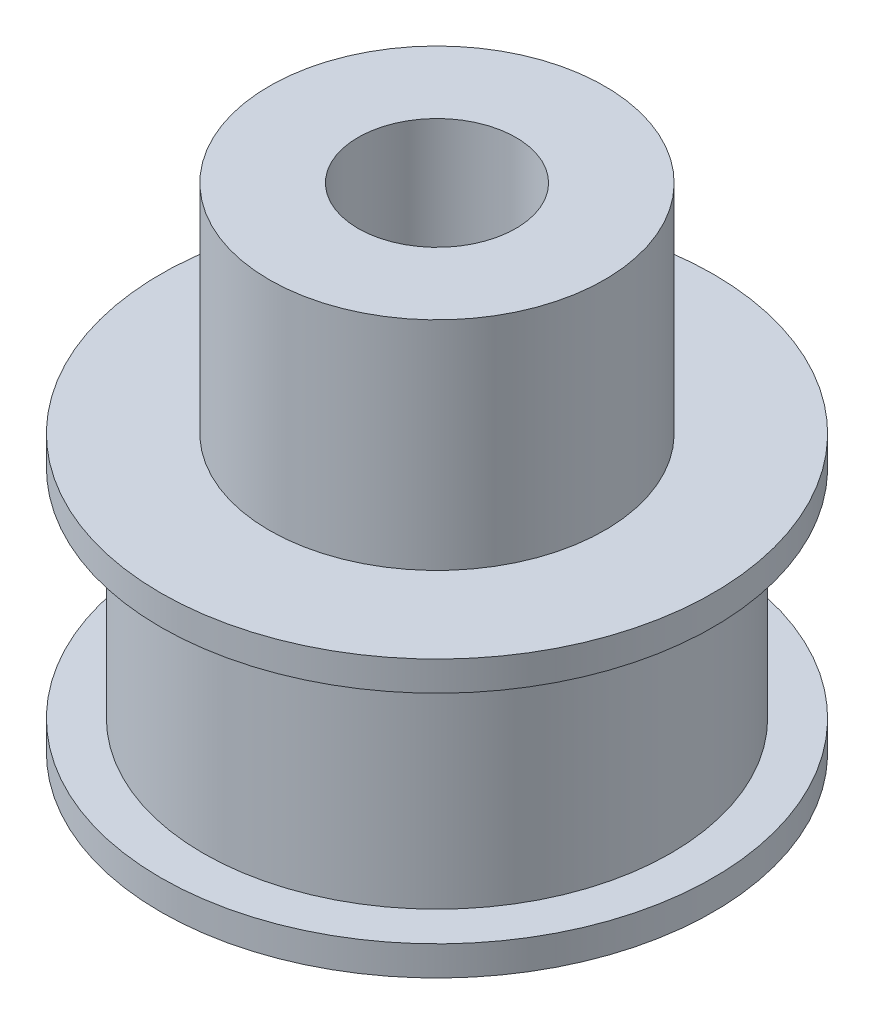
ISO-10303-21;
HEADER;
FILE_DESCRIPTION(('STEP AP214'),'2;1');
FILE_NAME('part.step','',(''),(''),'','','');
FILE_SCHEMA(('AUTOMOTIVE_DESIGN { 1 0 10303 214 1 1 1 1 }'));
ENDSEC;
DATA;
#1=APPLICATION_CONTEXT('core data for automotive mechanical design processes');
#2=APPLICATION_PROTOCOL_DEFINITION('international standard','automotive_design',2000,#1);
#3=PRODUCT_CONTEXT('',#1,'mechanical');
#4=PRODUCT('Part','Part','',(#3));
#5=PRODUCT_RELATED_PRODUCT_CATEGORY('part','',(#4));
#6=PRODUCT_DEFINITION_FORMATION('','',#4);
#7=PRODUCT_DEFINITION_CONTEXT('part definition',#1,'design');
#8=PRODUCT_DEFINITION('design','',#6,#7);
#9=PRODUCT_DEFINITION_SHAPE('','',#8);
#10=(LENGTH_UNIT() NAMED_UNIT(*) SI_UNIT(.MILLI.,.METRE.));
#11=(NAMED_UNIT(*) PLANE_ANGLE_UNIT() SI_UNIT($,.RADIAN.));
#12=(NAMED_UNIT(*) SI_UNIT($,.STERADIAN.) SOLID_ANGLE_UNIT());
#13=UNCERTAINTY_MEASURE_WITH_UNIT(LENGTH_MEASURE(1.E-05),#10,'distance_accuracy_value','');
#14=(GEOMETRIC_REPRESENTATION_CONTEXT(3) GLOBAL_UNCERTAINTY_ASSIGNED_CONTEXT((#13)) GLOBAL_UNIT_ASSIGNED_CONTEXT((#10,
#11,#12)) REPRESENTATION_CONTEXT('',''));
#15=CARTESIAN_POINT('',(0.,0.,0.));
#16=DIRECTION('',(0.,0.,1.));
#17=DIRECTION('',(1.,0.,0.));
#18=AXIS2_PLACEMENT_3D('',#15,#16,#17);
#19=CARTESIAN_POINT('',(0.,1.5,0.));
#20=DIRECTION('',(0.,-1.,0.));
#21=DIRECTION('',(0.,0.,-1.));
#22=AXIS2_PLACEMENT_3D('',#19,#20,#21);
#23=CYLINDRICAL_SURFACE('',#22,14.);
#24=CARTESIAN_POINT('',(0.,1.5,0.));
#25=DIRECTION('',(0.,1.,0.));
#26=DIRECTION('',(0.,0.,1.));
#27=AXIS2_PLACEMENT_3D('',#24,#25,#26);
#28=CIRCLE('',#27,14.);
#29=CARTESIAN_POINT('',(0.,1.5,14.));
#30=VERTEX_POINT('',#29);
#31=EDGE_CURVE('E10',#30,#30,#28,.T.);
#32=ORIENTED_EDGE('',*,*,#31,.F.);
#33=EDGE_LOOP('',(#32));
#34=FACE_BOUND('',#33,.T.);
#35=CARTESIAN_POINT('',(0.,0.,0.));
#36=DIRECTION('',(0.,1.,0.));
#37=DIRECTION('',(0.,0.,1.));
#38=AXIS2_PLACEMENT_3D('',#35,#36,#37);
#39=CIRCLE('',#38,14.);
#40=CARTESIAN_POINT('',(0.,0.,14.));
#41=VERTEX_POINT('',#40);
#42=EDGE_CURVE('E36',#41,#41,#39,.T.);
#43=ORIENTED_EDGE('',*,*,#42,.T.);
#44=EDGE_LOOP('',(#43));
#45=FACE_BOUND('',#44,.T.);
#46=ADVANCED_FACE('F33',(#34,#45),#23,.T.);
#47=CARTESIAN_POINT('',(0.,1.5,0.));
#48=DIRECTION('',(0.,1.,0.));
#49=DIRECTION('',(0.,0.,1.));
#50=AXIS2_PLACEMENT_3D('',#47,#48,#49);
#51=PLANE('',#50);
#52=CARTESIAN_POINT('',(0.,1.5,0.));
#53=DIRECTION('',(0.,1.,0.));
#54=DIRECTION('',(0.,0.,1.));
#55=AXIS2_PLACEMENT_3D('',#52,#53,#54);
#56=CIRCLE('',#55,11.85);
#57=CARTESIAN_POINT('',(0.,1.5,11.85));
#58=VERTEX_POINT('',#57);
#59=EDGE_CURVE('E45',#58,#58,#56,.T.);
#60=ORIENTED_EDGE('',*,*,#59,.F.);
#61=EDGE_LOOP('',(#60));
#62=FACE_BOUND('',#61,.T.);
#63=ORIENTED_EDGE('',*,*,#31,.T.);
#64=EDGE_LOOP('',(#63));
#65=FACE_BOUND('',#64,.T.);
#66=ADVANCED_FACE('F110',(#62,#65),#51,.T.);
#67=CARTESIAN_POINT('',(0.,0.,0.));
#68=DIRECTION('',(0.,1.,0.));
#69=DIRECTION('',(0.,0.,1.));
#70=AXIS2_PLACEMENT_3D('',#67,#68,#69);
#71=PLANE('',#70);
#72=CARTESIAN_POINT('',(0.,0.,0.));
#73=DIRECTION('',(0.,1.,0.));
#74=DIRECTION('',(0.,0.,1.));
#75=AXIS2_PLACEMENT_3D('',#72,#73,#74);
#76=CIRCLE('',#75,4.);
#77=CARTESIAN_POINT('',(0.,0.,4.));
#78=VERTEX_POINT('',#77);
#79=EDGE_CURVE('E60',#78,#78,#76,.T.);
#80=ORIENTED_EDGE('',*,*,#79,.T.);
#81=EDGE_LOOP('',(#80));
#82=FACE_BOUND('',#81,.T.);
#83=ORIENTED_EDGE('',*,*,#42,.F.);
#84=EDGE_LOOP('',(#83));
#85=FACE_BOUND('',#84,.T.);
#86=ADVANCED_FACE('F69',(#82,#85),#71,.F.);
#87=CARTESIAN_POINT('',(0.,12.5,0.));
#88=DIRECTION('',(0.,-1.,0.));
#89=DIRECTION('',(0.,0.,-1.));
#90=AXIS2_PLACEMENT_3D('',#87,#88,#89);
#91=CYLINDRICAL_SURFACE('',#90,11.85);
#92=CARTESIAN_POINT('',(0.,12.5,0.));
#93=DIRECTION('',(0.,1.,0.));
#94=DIRECTION('',(0.,0.,1.));
#95=AXIS2_PLACEMENT_3D('',#92,#93,#94);
#96=CIRCLE('',#95,11.85);
#97=CARTESIAN_POINT('',(0.,12.5,11.85));
#98=VERTEX_POINT('',#97);
#99=EDGE_CURVE('E43',#98,#98,#96,.T.);
#100=ORIENTED_EDGE('',*,*,#99,.F.);
#101=EDGE_LOOP('',(#100));
#102=FACE_BOUND('',#101,.T.);
#103=ORIENTED_EDGE('',*,*,#59,.T.);
#104=EDGE_LOOP('',(#103));
#105=FACE_BOUND('',#104,.T.);
#106=ADVANCED_FACE('F100',(#102,#105),#91,.T.);
#107=CARTESIAN_POINT('',(0.,14.,0.));
#108=DIRECTION('',(0.,-1.,0.));
#109=DIRECTION('',(0.,0.,-1.));
#110=AXIS2_PLACEMENT_3D('',#107,#108,#109);
#111=CYLINDRICAL_SURFACE('',#110,14.);
#112=CARTESIAN_POINT('',(0.,14.,0.));
#113=DIRECTION('',(0.,1.,0.));
#114=DIRECTION('',(0.,0.,1.));
#115=AXIS2_PLACEMENT_3D('',#112,#113,#114);
#116=CIRCLE('',#115,14.);
#117=CARTESIAN_POINT('',(0.,14.,14.));
#118=VERTEX_POINT('',#117);
#119=EDGE_CURVE('E48',#118,#118,#116,.T.);
#120=ORIENTED_EDGE('',*,*,#119,.F.);
#121=EDGE_LOOP('',(#120));
#122=FACE_BOUND('',#121,.T.);
#123=CARTESIAN_POINT('',(0.,12.5,0.));
#124=DIRECTION('',(0.,1.,0.));
#125=DIRECTION('',(0.,0.,1.));
#126=AXIS2_PLACEMENT_3D('',#123,#124,#125);
#127=CIRCLE('',#126,14.);
#128=CARTESIAN_POINT('',(0.,12.5,14.));
#129=VERTEX_POINT('',#128);
#130=EDGE_CURVE('E51',#129,#129,#127,.T.);
#131=ORIENTED_EDGE('',*,*,#130,.T.);
#132=EDGE_LOOP('',(#131));
#133=FACE_BOUND('',#132,.T.);
#134=ADVANCED_FACE('F94',(#122,#133),#111,.T.);
#135=CARTESIAN_POINT('',(0.,14.,0.));
#136=DIRECTION('',(0.,1.,0.));
#137=DIRECTION('',(0.,0.,1.));
#138=AXIS2_PLACEMENT_3D('',#135,#136,#137);
#139=PLANE('',#138);
#140=CARTESIAN_POINT('',(0.,14.,0.));
#141=DIRECTION('',(0.,1.,0.));
#142=DIRECTION('',(0.,0.,1.));
#143=AXIS2_PLACEMENT_3D('',#140,#141,#142);
#144=CIRCLE('',#143,8.5);
#145=CARTESIAN_POINT('',(0.,14.,8.5));
#146=VERTEX_POINT('',#145);
#147=EDGE_CURVE('E57',#146,#146,#144,.T.);
#148=ORIENTED_EDGE('',*,*,#147,.F.);
#149=EDGE_LOOP('',(#148));
#150=FACE_BOUND('',#149,.T.);
#151=ORIENTED_EDGE('',*,*,#119,.T.);
#152=EDGE_LOOP('',(#151));
#153=FACE_BOUND('',#152,.T.);
#154=ADVANCED_FACE('F91',(#150,#153),#139,.T.);
#155=CARTESIAN_POINT('',(0.,12.5,0.));
#156=DIRECTION('',(0.,1.,0.));
#157=DIRECTION('',(0.,0.,1.));
#158=AXIS2_PLACEMENT_3D('',#155,#156,#157);
#159=PLANE('',#158);
#160=ORIENTED_EDGE('',*,*,#99,.T.);
#161=EDGE_LOOP('',(#160));
#162=FACE_BOUND('',#161,.T.);
#163=ORIENTED_EDGE('',*,*,#130,.F.);
#164=EDGE_LOOP('',(#163));
#165=FACE_BOUND('',#164,.T.);
#166=ADVANCED_FACE('F87',(#162,#165),#159,.F.);
#167=CARTESIAN_POINT('',(0.,25.,0.));
#168=DIRECTION('',(0.,-1.,0.));
#169=DIRECTION('',(0.,0.,-1.));
#170=AXIS2_PLACEMENT_3D('',#167,#168,#169);
#171=CYLINDRICAL_SURFACE('',#170,8.5);
#172=CARTESIAN_POINT('',(0.,25.,0.));
#173=DIRECTION('',(0.,1.,0.));
#174=DIRECTION('',(0.,0.,1.));
#175=AXIS2_PLACEMENT_3D('',#172,#173,#174);
#176=CIRCLE('',#175,8.5);
#177=CARTESIAN_POINT('',(0.,25.,8.5));
#178=VERTEX_POINT('',#177);
#179=EDGE_CURVE('E54',#178,#178,#176,.T.);
#180=ORIENTED_EDGE('',*,*,#179,.F.);
#181=EDGE_LOOP('',(#180));
#182=FACE_BOUND('',#181,.T.);
#183=ORIENTED_EDGE('',*,*,#147,.T.);
#184=EDGE_LOOP('',(#183));
#185=FACE_BOUND('',#184,.T.);
#186=ADVANCED_FACE('F81',(#182,#185),#171,.T.);
#187=CARTESIAN_POINT('',(0.,25.,0.));
#188=DIRECTION('',(0.,1.,0.));
#189=DIRECTION('',(0.,0.,1.));
#190=AXIS2_PLACEMENT_3D('',#187,#188,#189);
#191=PLANE('',#190);
#192=CARTESIAN_POINT('',(0.,25.,0.));
#193=DIRECTION('',(0.,1.,0.));
#194=DIRECTION('',(0.,0.,1.));
#195=AXIS2_PLACEMENT_3D('',#192,#193,#194);
#196=CIRCLE('',#195,4.);
#197=CARTESIAN_POINT('',(0.,25.,4.));
#198=VERTEX_POINT('',#197);
#199=EDGE_CURVE('E63',#198,#198,#196,.T.);
#200=ORIENTED_EDGE('',*,*,#199,.F.);
#201=EDGE_LOOP('',(#200));
#202=FACE_BOUND('',#201,.T.);
#203=ORIENTED_EDGE('',*,*,#179,.T.);
#204=EDGE_LOOP('',(#203));
#205=FACE_BOUND('',#204,.T.);
#206=ADVANCED_FACE('F75',(#202,#205),#191,.T.);
#207=CARTESIAN_POINT('',(0.,0.,0.));
#208=DIRECTION('',(0.,1.,0.));
#209=DIRECTION('',(0.,0.,1.));
#210=AXIS2_PLACEMENT_3D('',#207,#208,#209);
#211=CYLINDRICAL_SURFACE('',#210,4.);
#212=ORIENTED_EDGE('',*,*,#79,.F.);
#213=EDGE_LOOP('',(#212));
#214=FACE_BOUND('',#213,.T.);
#215=ORIENTED_EDGE('',*,*,#199,.T.);
#216=EDGE_LOOP('',(#215));
#217=FACE_BOUND('',#216,.T.);
#218=ADVANCED_FACE('F72',(#214,#217),#211,.F.);
#219=CLOSED_SHELL('',(#46,#66,#86,#106,#134,#154,#166,#186,#206,#218));
#220=MANIFOLD_SOLID_BREP('B2',#219);
#221=ADVANCED_BREP_SHAPE_REPRESENTATION('',(#18,#220),#14);
#222=SHAPE_DEFINITION_REPRESENTATION(#9,#221);
ENDSEC;
END-ISO-10303-21;
